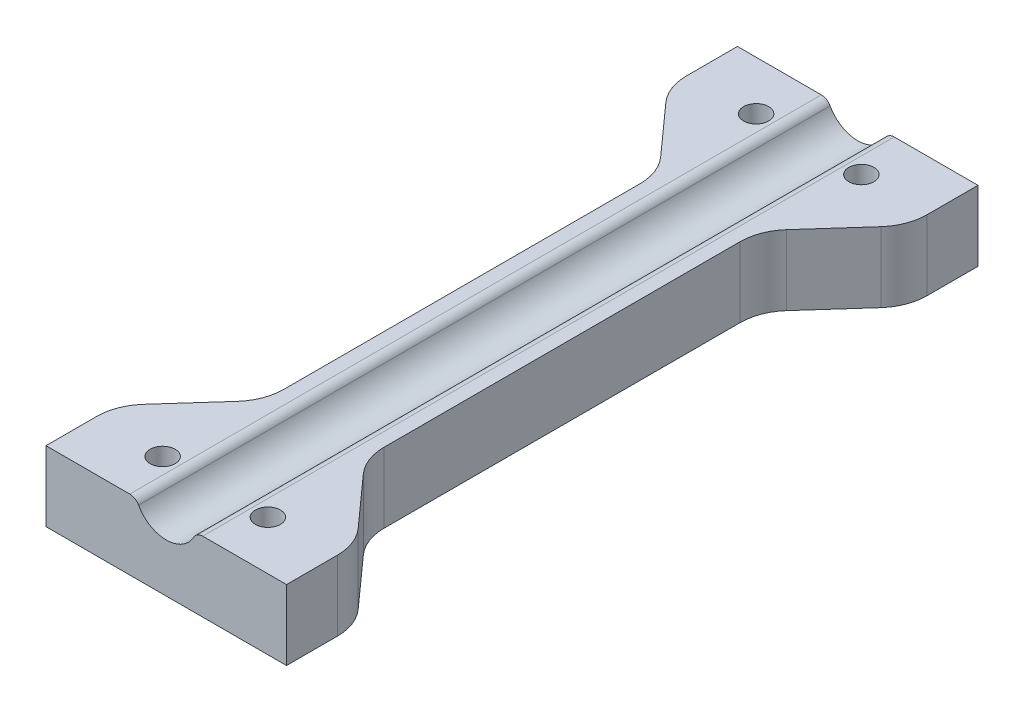
ISO-10303-21;
HEADER;
FILE_DESCRIPTION(('STEP AP214'),'2;1');
FILE_NAME('part.step','',(''),(''),'','','');
FILE_SCHEMA(('AUTOMOTIVE_DESIGN { 1 0 10303 214 1 1 1 1 }'));
ENDSEC;
DATA;
#1=APPLICATION_CONTEXT('core data for automotive mechanical design processes');
#2=APPLICATION_PROTOCOL_DEFINITION('international standard','automotive_design',2000,#1);
#3=PRODUCT_CONTEXT('',#1,'mechanical');
#4=PRODUCT('Part','Part','',(#3));
#5=PRODUCT_RELATED_PRODUCT_CATEGORY('part','',(#4));
#6=PRODUCT_DEFINITION_FORMATION('','',#4);
#7=PRODUCT_DEFINITION_CONTEXT('part definition',#1,'design');
#8=PRODUCT_DEFINITION('design','',#6,#7);
#9=PRODUCT_DEFINITION_SHAPE('','',#8);
#10=(LENGTH_UNIT() NAMED_UNIT(*) SI_UNIT(.MILLI.,.METRE.));
#11=(NAMED_UNIT(*) PLANE_ANGLE_UNIT() SI_UNIT($,.RADIAN.));
#12=(NAMED_UNIT(*) SI_UNIT($,.STERADIAN.) SOLID_ANGLE_UNIT());
#13=UNCERTAINTY_MEASURE_WITH_UNIT(LENGTH_MEASURE(1.E-05),#10,'distance_accuracy_value','');
#14=(GEOMETRIC_REPRESENTATION_CONTEXT(3) GLOBAL_UNCERTAINTY_ASSIGNED_CONTEXT((#13)) GLOBAL_UNIT_ASSIGNED_CONTEXT((#10,
#11,#12)) REPRESENTATION_CONTEXT('',''));
#15=CARTESIAN_POINT('',(0.,0.,0.));
#16=DIRECTION('',(0.,0.,1.));
#17=DIRECTION('',(1.,0.,0.));
#18=AXIS2_PLACEMENT_3D('',#15,#16,#17);
#19=CARTESIAN_POINT('',(12.,-0.999999999999997,34.5));
#20=DIRECTION('',(-1.,0.,0.));
#21=DIRECTION('',(0.,-1.,0.));
#22=AXIS2_PLACEMENT_3D('',#19,#20,#21);
#23=PLANE('',#22);
#24=DIRECTION('',(0.,0.,-1.));
#25=VECTOR('',#24,1.);
#26=CARTESIAN_POINT('',(12.,-8.,34.5));
#27=LINE('',#26,#25);
#28=CARTESIAN_POINT('',(12.,-8.,34.5));
#29=VERTEX_POINT('',#28);
#30=CARTESIAN_POINT('',(12.,-8.,29.4121761673145));
#31=VERTEX_POINT('',#30);
#32=EDGE_CURVE('E451',#29,#31,#27,.T.);
#33=ORIENTED_EDGE('',*,*,#32,.T.);
#34=DIRECTION('',(0.,1.,0.));
#35=VECTOR('',#34,1.);
#36=CARTESIAN_POINT('',(12.,-0.999999999999994,29.4121761673145));
#37=LINE('',#36,#35);
#38=CARTESIAN_POINT('',(12.,-0.999999999999997,29.4121761673145));
#39=VERTEX_POINT('',#38);
#40=EDGE_CURVE('E222',#31,#39,#37,.T.);
#41=ORIENTED_EDGE('',*,*,#40,.T.);
#42=DIRECTION('',(0.,0.,-1.));
#43=VECTOR('',#42,1.);
#44=CARTESIAN_POINT('',(12.,-0.999999999999997,34.5));
#45=LINE('',#44,#43);
#46=CARTESIAN_POINT('',(12.,-0.999999999999997,34.5));
#47=VERTEX_POINT('',#46);
#48=EDGE_CURVE('E200',#47,#39,#45,.T.);
#49=ORIENTED_EDGE('',*,*,#48,.F.);
#50=DIRECTION('',(0.,1.,0.));
#51=VECTOR('',#50,1.);
#52=CARTESIAN_POINT('',(12.,-0.999999999999997,34.5));
#53=LINE('',#52,#51);
#54=EDGE_CURVE('E208',#29,#47,#53,.T.);
#55=ORIENTED_EDGE('',*,*,#54,.F.);
#56=EDGE_LOOP('',(#33,#41,#49,#55));
#57=FACE_BOUND('',#56,.T.);
#58=ADVANCED_FACE('F38',(#57),#23,.F.);
#59=CARTESIAN_POINT('',(-12.,-1.,34.5));
#60=DIRECTION('',(1.,0.,0.));
#61=DIRECTION('',(0.,1.,0.));
#62=AXIS2_PLACEMENT_3D('',#59,#60,#61);
#63=PLANE('',#62);
#64=DIRECTION('',(0.,0.,-1.));
#65=VECTOR('',#64,1.);
#66=CARTESIAN_POINT('',(-12.,-8.,34.5));
#67=LINE('',#66,#65);
#68=CARTESIAN_POINT('',(-12.,-8.,-29.4121761673145));
#69=VERTEX_POINT('',#68);
#70=CARTESIAN_POINT('',(-12.,-8.,-34.5));
#71=VERTEX_POINT('',#70);
#72=EDGE_CURVE('E453',#69,#71,#67,.T.);
#73=ORIENTED_EDGE('',*,*,#72,.F.);
#74=DIRECTION('',(0.,1.,0.));
#75=VECTOR('',#74,1.);
#76=CARTESIAN_POINT('',(-12.,-0.999999999999946,-29.4121761673145));
#77=LINE('',#76,#75);
#78=CARTESIAN_POINT('',(-12.,-1.,-29.4121761673145));
#79=VERTEX_POINT('',#78);
#80=EDGE_CURVE('E312',#69,#79,#77,.T.);
#81=ORIENTED_EDGE('',*,*,#80,.T.);
#82=DIRECTION('',(0.,0.,-1.));
#83=VECTOR('',#82,1.);
#84=CARTESIAN_POINT('',(-12.,-1.,34.5));
#85=LINE('',#84,#83);
#86=CARTESIAN_POINT('',(-12.,-1.,-34.5));
#87=VERTEX_POINT('',#86);
#88=EDGE_CURVE('E456',#79,#87,#85,.T.);
#89=ORIENTED_EDGE('',*,*,#88,.T.);
#90=DIRECTION('',(0.,-1.,0.));
#91=VECTOR('',#90,1.);
#92=CARTESIAN_POINT('',(-12.,-1.,-34.5));
#93=LINE('',#92,#91);
#94=EDGE_CURVE('E444',#87,#71,#93,.T.);
#95=ORIENTED_EDGE('',*,*,#94,.T.);
#96=EDGE_LOOP('',(#73,#81,#89,#95));
#97=FACE_BOUND('',#96,.T.);
#98=ADVANCED_FACE('F468',(#97),#63,.F.);
#99=CARTESIAN_POINT('',(12.,-0.999999999999997,-29.4121761673145));
#100=VERTEX_POINT('',#99);
#101=CARTESIAN_POINT('',(12.,-0.999999999999997,-34.5));
#102=VERTEX_POINT('',#101);
#103=EDGE_CURVE('E225',#100,#102,#45,.T.);
#104=ORIENTED_EDGE('',*,*,#103,.F.);
#105=DIRECTION('',(0.,1.,0.));
#106=VECTOR('',#105,1.);
#107=CARTESIAN_POINT('',(12.,-1.00000000000003,-29.4121761673145));
#108=LINE('',#107,#106);
#109=CARTESIAN_POINT('',(12.,-8.,-29.4121761673145));
#110=VERTEX_POINT('',#109);
#111=EDGE_CURVE('E330',#100,#110,#108,.F.);
#112=ORIENTED_EDGE('',*,*,#111,.T.);
#113=CARTESIAN_POINT('',(12.,-8.,-34.5));
#114=VERTEX_POINT('',#113);
#115=EDGE_CURVE('E429',#110,#114,#27,.T.);
#116=ORIENTED_EDGE('',*,*,#115,.T.);
#117=DIRECTION('',(0.,1.,0.));
#118=VECTOR('',#117,1.);
#119=CARTESIAN_POINT('',(12.,-0.999999999999997,-34.5));
#120=LINE('',#119,#118);
#121=EDGE_CURVE('E371',#114,#102,#120,.T.);
#122=ORIENTED_EDGE('',*,*,#121,.T.);
#123=EDGE_LOOP('',(#104,#112,#116,#122));
#124=FACE_BOUND('',#123,.T.);
#125=ADVANCED_FACE('F476',(#124),#23,.F.);
#126=CARTESIAN_POINT('',(12.,-0.999999999999997,34.5));
#127=DIRECTION('',(0.,-1.,0.));
#128=DIRECTION('',(1.,0.,0.));
#129=AXIS2_PLACEMENT_3D('',#126,#127,#128);
#130=PLANE('',#129);
#131=CARTESIAN_POINT('',(5.25,-0.999999999999999,29.6101918186068));
#132=DIRECTION('',(0.,1.,0.));
#133=DIRECTION('',(1.,0.,0.));
#134=AXIS2_PLACEMENT_3D('',#131,#132,#133);
#135=CIRCLE('',#134,1.25);
#136=CARTESIAN_POINT('',(6.5,-0.999999999999999,29.6101918186068));
#137=VERTEX_POINT('',#136);
#138=EDGE_CURVE('E496',#137,#137,#135,.T.);
#139=ORIENTED_EDGE('',*,*,#138,.F.);
#140=EDGE_LOOP('',(#139));
#141=FACE_BOUND('',#140,.T.);
#142=CARTESIAN_POINT('',(5.25,-0.999999999999999,-29.6101918186068));
#143=DIRECTION('',(0.,1.,0.));
#144=DIRECTION('',(-1.,0.,0.));
#145=AXIS2_PLACEMENT_3D('',#142,#143,#144);
#146=CIRCLE('',#145,1.25);
#147=CARTESIAN_POINT('',(4.,-0.999999999999999,-29.6101918186068));
#148=VERTEX_POINT('',#147);
#149=EDGE_CURVE('E488',#148,#148,#146,.T.);
#150=ORIENTED_EDGE('',*,*,#149,.F.);
#151=EDGE_LOOP('',(#150));
#152=FACE_BOUND('',#151,.T.);
#153=ORIENTED_EDGE('',*,*,#48,.T.);
#154=CARTESIAN_POINT('',(7.,-0.999999999999998,29.4121761673145));
#155=DIRECTION('',(0.,-1.,0.));
#156=DIRECTION('',(1.,0.,0.));
#157=AXIS2_PLACEMENT_3D('',#154,#155,#156);
#158=CIRCLE('',#157,5.);
#159=CARTESIAN_POINT('',(10.7240492744831,-0.999999999999997,26.0757923462858));
#160=VERTEX_POINT('',#159);
#161=EDGE_CURVE('E309',#39,#160,#158,.F.);
#162=ORIENTED_EDGE('',*,*,#161,.T.);
#163=DIRECTION('',(0.667276764205734,0.,0.74480985489662));
#164=VECTOR('',#163,1.);
#165=CARTESIAN_POINT('',(12.,-0.999999999999997,27.5));
#166=LINE('',#165,#164);
#167=CARTESIAN_POINT('',(6.2759507255169,-0.999999999999999,21.1108545385609));
#168=VERTEX_POINT('',#167);
#169=EDGE_CURVE('E400',#168,#160,#166,.T.);
#170=ORIENTED_EDGE('',*,*,#169,.F.);
#171=CARTESIAN_POINT('',(10.,-0.999999999999998,17.7744707175322));
#172=DIRECTION('',(0.,-1.,0.));
#173=DIRECTION('',(1.,0.,0.));
#174=AXIS2_PLACEMENT_3D('',#171,#172,#173);
#175=CIRCLE('',#174,5.);
#176=CARTESIAN_POINT('',(5.,-0.999999999999999,17.7744707175322));
#177=VERTEX_POINT('',#176);
#178=EDGE_CURVE('E339',#168,#177,#175,.T.);
#179=ORIENTED_EDGE('',*,*,#178,.T.);
#180=DIRECTION('',(0.,0.,1.));
#181=VECTOR('',#180,1.);
#182=CARTESIAN_POINT('',(5.,-0.999999999999999,-19.6866468848466));
#183=LINE('',#182,#181);
#184=CARTESIAN_POINT('',(5.,-0.999999999999999,-17.7744707175322));
#185=VERTEX_POINT('',#184);
#186=EDGE_CURVE('E410',#185,#177,#183,.T.);
#187=ORIENTED_EDGE('',*,*,#186,.F.);
#188=CARTESIAN_POINT('',(10.,-0.999999999999998,-17.7744707175322));
#189=DIRECTION('',(0.,-1.,0.));
#190=DIRECTION('',(1.,0.,0.));
#191=AXIS2_PLACEMENT_3D('',#188,#189,#190);
#192=CIRCLE('',#191,5.);
#193=CARTESIAN_POINT('',(6.27595072551689,-0.999999999999999,-21.1108545385609));
#194=VERTEX_POINT('',#193);
#195=EDGE_CURVE('E47',#185,#194,#192,.T.);
#196=ORIENTED_EDGE('',*,*,#195,.T.);
#197=DIRECTION('',(-0.667276764205734,0.,0.74480985489662));
#198=VECTOR('',#197,1.);
#199=CARTESIAN_POINT('',(12.,-0.999999999999997,-27.5));
#200=LINE('',#199,#198);
#201=CARTESIAN_POINT('',(10.7240492744831,-0.999999999999997,-26.0757923462858));
#202=VERTEX_POINT('',#201);
#203=EDGE_CURVE('E407',#202,#194,#200,.T.);
#204=ORIENTED_EDGE('',*,*,#203,.F.);
#205=CARTESIAN_POINT('',(7.,-0.999999999999999,-29.4121761673145));
#206=DIRECTION('',(0.,-1.,0.));
#207=DIRECTION('',(1.,0.,0.));
#208=AXIS2_PLACEMENT_3D('',#205,#206,#207);
#209=CIRCLE('',#208,5.);
#210=EDGE_CURVE('E54',#202,#100,#209,.F.);
#211=ORIENTED_EDGE('',*,*,#210,.T.);
#212=ORIENTED_EDGE('',*,*,#103,.T.);
#213=DIRECTION('',(-1.,0.,0.));
#214=VECTOR('',#213,1.);
#215=CARTESIAN_POINT('',(12.,-0.999999999999997,-34.5));
#216=LINE('',#215,#214);
#217=CARTESIAN_POINT('',(3.63627556711534,-0.999999999999999,-34.5));
#218=VERTEX_POINT('',#217);
#219=EDGE_CURVE('E433',#102,#218,#216,.T.);
#220=ORIENTED_EDGE('',*,*,#219,.T.);
#221=DIRECTION('',(0.,0.,-1.));
#222=VECTOR('',#221,1.);
#223=CARTESIAN_POINT('',(3.63627556711534,-0.999999999999999,34.5));
#224=LINE('',#223,#222);
#225=CARTESIAN_POINT('',(3.63627556711534,-0.999999999999999,34.5));
#226=VERTEX_POINT('',#225);
#227=EDGE_CURVE('E203',#218,#226,#224,.F.);
#228=ORIENTED_EDGE('',*,*,#227,.T.);
#229=DIRECTION('',(-1.,0.,0.));
#230=VECTOR('',#229,1.);
#231=CARTESIAN_POINT('',(12.,-0.999999999999997,34.5));
#232=LINE('',#231,#230);
#233=EDGE_CURVE('E196',#47,#226,#232,.T.);
#234=ORIENTED_EDGE('',*,*,#233,.F.);
#235=EDGE_LOOP('',(#153,#162,#170,#179,#187,#196,#204,#211,#212,#220,#228,#234));
#236=FACE_BOUND('',#235,.T.);
#237=ADVANCED_FACE('F198',(#141,#152,#236),#130,.F.);
#238=CARTESIAN_POINT('',(0.,0.,34.5));
#239=DIRECTION('',(0.,0.,-1.));
#240=DIRECTION('',(-1.,0.,0.));
#241=AXIS2_PLACEMENT_3D('',#238,#239,#240);
#242=CYLINDRICAL_SURFACE('',#241,3.15);
#243=CARTESIAN_POINT('',(0.,0.,34.5));
#244=DIRECTION('',(0.,0.,-1.));
#245=DIRECTION('',(1.,0.,0.));
#246=AXIS2_PLACEMENT_3D('',#243,#244,#245);
#247=CIRCLE('',#246,3.15);
#248=CARTESIAN_POINT('',(2.76006458708755,-1.51807228915663,34.5));
#249=VERTEX_POINT('',#248);
#250=CARTESIAN_POINT('',(-2.76006458708755,-1.51807228915663,34.5));
#251=VERTEX_POINT('',#250);
#252=EDGE_CURVE('E207',#249,#251,#247,.T.);
#253=ORIENTED_EDGE('',*,*,#252,.F.);
#254=DIRECTION('',(0.,0.,-1.));
#255=VECTOR('',#254,1.);
#256=CARTESIAN_POINT('',(2.76006458708755,-1.51807228915663,34.5));
#257=LINE('',#256,#255);
#258=CARTESIAN_POINT('',(2.76006458708755,-1.51807228915663,-34.5));
#259=VERTEX_POINT('',#258);
#260=EDGE_CURVE('E229',#249,#259,#257,.T.);
#261=ORIENTED_EDGE('',*,*,#260,.T.);
#262=CARTESIAN_POINT('',(0.,0.,-34.5));
#263=DIRECTION('',(0.,0.,-1.));
#264=DIRECTION('',(1.,0.,0.));
#265=AXIS2_PLACEMENT_3D('',#262,#263,#264);
#266=CIRCLE('',#265,3.15);
#267=CARTESIAN_POINT('',(-2.76006458708755,-1.51807228915663,-34.5));
#268=VERTEX_POINT('',#267);
#269=EDGE_CURVE('E436',#259,#268,#266,.T.);
#270=ORIENTED_EDGE('',*,*,#269,.T.);
#271=DIRECTION('',(0.,0.,-1.));
#272=VECTOR('',#271,1.);
#273=CARTESIAN_POINT('',(-2.76006458708755,-1.51807228915663,34.5));
#274=LINE('',#273,#272);
#275=EDGE_CURVE('E224',#268,#251,#274,.F.);
#276=ORIENTED_EDGE('',*,*,#275,.T.);
#277=EDGE_LOOP('',(#253,#261,#270,#276));
#278=FACE_BOUND('',#277,.T.);
#279=ADVANCED_FACE('F532',(#278),#242,.F.);
#280=CARTESIAN_POINT('',(-12.,-1.,34.5));
#281=DIRECTION('',(0.,-1.,0.));
#282=DIRECTION('',(0.,0.,-1.));
#283=AXIS2_PLACEMENT_3D('',#280,#281,#282);
#284=PLANE('',#283);
#285=CARTESIAN_POINT('',(-5.25,-1.,29.6101918186068));
#286=DIRECTION('',(0.,1.,0.));
#287=DIRECTION('',(1.,0.,0.));
#288=AXIS2_PLACEMENT_3D('',#285,#286,#287);
#289=CIRCLE('',#288,1.25);
#290=CARTESIAN_POINT('',(-4.,-1.,29.6101918186068));
#291=VERTEX_POINT('',#290);
#292=EDGE_CURVE('E504',#291,#291,#289,.T.);
#293=ORIENTED_EDGE('',*,*,#292,.F.);
#294=EDGE_LOOP('',(#293));
#295=FACE_BOUND('',#294,.T.);
#296=CARTESIAN_POINT('',(-5.25,-1.,-29.6101918186068));
#297=DIRECTION('',(0.,1.,0.));
#298=DIRECTION('',(-1.,0.,0.));
#299=AXIS2_PLACEMENT_3D('',#296,#297,#298);
#300=CIRCLE('',#299,1.25);
#301=CARTESIAN_POINT('',(-6.5,-1.,-29.6101918186068));
#302=VERTEX_POINT('',#301);
#303=EDGE_CURVE('E512',#302,#302,#300,.T.);
#304=ORIENTED_EDGE('',*,*,#303,.F.);
#305=EDGE_LOOP('',(#304));
#306=FACE_BOUND('',#305,.T.);
#307=DIRECTION('',(0.667276764205734,0.,-0.74480985489662));
#308=VECTOR('',#307,1.);
#309=CARTESIAN_POINT('',(-12.,-1.,27.5));
#310=LINE('',#309,#308);
#311=CARTESIAN_POINT('',(-10.7240492744831,-1.,26.0757923462858));
#312=VERTEX_POINT('',#311);
#313=CARTESIAN_POINT('',(-6.2759507255169,-1.,21.1108545385609));
#314=VERTEX_POINT('',#313);
#315=EDGE_CURVE('E385',#312,#314,#310,.T.);
#316=ORIENTED_EDGE('',*,*,#315,.F.);
#317=CARTESIAN_POINT('',(-7.,-1.,29.4121761673145));
#318=DIRECTION('',(0.,-1.,0.));
#319=DIRECTION('',(0.,0.,-1.));
#320=AXIS2_PLACEMENT_3D('',#317,#318,#319);
#321=CIRCLE('',#320,5.);
#322=CARTESIAN_POINT('',(-12.,-1.,29.4121761673145));
#323=VERTEX_POINT('',#322);
#324=EDGE_CURVE('E266',#312,#323,#321,.F.);
#325=ORIENTED_EDGE('',*,*,#324,.T.);
#326=CARTESIAN_POINT('',(-12.,-1.,34.5));
#327=VERTEX_POINT('',#326);
#328=EDGE_CURVE('E231',#327,#323,#85,.T.);
#329=ORIENTED_EDGE('',*,*,#328,.F.);
#330=DIRECTION('',(-1.,0.,0.));
#331=VECTOR('',#330,1.);
#332=CARTESIAN_POINT('',(-12.,-1.,34.5));
#333=LINE('',#332,#331);
#334=CARTESIAN_POINT('',(-3.63627556711534,-1.,34.5));
#335=VERTEX_POINT('',#334);
#336=EDGE_CURVE('E421',#335,#327,#333,.T.);
#337=ORIENTED_EDGE('',*,*,#336,.F.);
#338=DIRECTION('',(0.,0.,-1.));
#339=VECTOR('',#338,1.);
#340=CARTESIAN_POINT('',(-3.63627556711534,-1.,34.5));
#341=LINE('',#340,#339);
#342=CARTESIAN_POINT('',(-3.63627556711534,-1.,-34.5));
#343=VERTEX_POINT('',#342);
#344=EDGE_CURVE('E252',#335,#343,#341,.T.);
#345=ORIENTED_EDGE('',*,*,#344,.T.);
#346=DIRECTION('',(-1.,0.,0.));
#347=VECTOR('',#346,1.);
#348=CARTESIAN_POINT('',(-12.,-1.,-34.5));
#349=LINE('',#348,#347);
#350=EDGE_CURVE('E440',#343,#87,#349,.T.);
#351=ORIENTED_EDGE('',*,*,#350,.T.);
#352=ORIENTED_EDGE('',*,*,#88,.F.);
#353=CARTESIAN_POINT('',(-7.,-1.,-29.4121761673145));
#354=DIRECTION('',(0.,-1.,0.));
#355=DIRECTION('',(0.,0.,-1.));
#356=AXIS2_PLACEMENT_3D('',#353,#354,#355);
#357=CIRCLE('',#356,5.);
#358=CARTESIAN_POINT('',(-10.7240492744831,-1.,-26.0757923462858));
#359=VERTEX_POINT('',#358);
#360=EDGE_CURVE('E263',#79,#359,#357,.F.);
#361=ORIENTED_EDGE('',*,*,#360,.T.);
#362=DIRECTION('',(-0.667276764205734,0.,-0.74480985489662));
#363=VECTOR('',#362,1.);
#364=CARTESIAN_POINT('',(-12.,-1.,-27.5));
#365=LINE('',#364,#363);
#366=CARTESIAN_POINT('',(-6.2759507255169,-1.,-21.1108545385609));
#367=VERTEX_POINT('',#366);
#368=EDGE_CURVE('E380',#367,#359,#365,.T.);
#369=ORIENTED_EDGE('',*,*,#368,.F.);
#370=CARTESIAN_POINT('',(-10.,-1.,-17.7744707175322));
#371=DIRECTION('',(0.,-1.,0.));
#372=DIRECTION('',(0.,0.,-1.));
#373=AXIS2_PLACEMENT_3D('',#370,#371,#372);
#374=CIRCLE('',#373,5.);
#375=CARTESIAN_POINT('',(-5.,-1.,-17.7744707175322));
#376=VERTEX_POINT('',#375);
#377=EDGE_CURVE('E345',#367,#376,#374,.T.);
#378=ORIENTED_EDGE('',*,*,#377,.T.);
#379=DIRECTION('',(0.,0.,-1.));
#380=VECTOR('',#379,1.);
#381=CARTESIAN_POINT('',(-5.,-1.,-19.6866468848466));
#382=LINE('',#381,#380);
#383=CARTESIAN_POINT('',(-5.,-1.,17.7744707175322));
#384=VERTEX_POINT('',#383);
#385=EDGE_CURVE('E379',#384,#376,#382,.T.);
#386=ORIENTED_EDGE('',*,*,#385,.F.);
#387=CARTESIAN_POINT('',(-10.,-1.,17.7744707175322));
#388=DIRECTION('',(0.,-1.,0.));
#389=DIRECTION('',(0.,0.,-1.));
#390=AXIS2_PLACEMENT_3D('',#387,#388,#389);
#391=CIRCLE('',#390,5.);
#392=EDGE_CURVE('E333',#384,#314,#391,.T.);
#393=ORIENTED_EDGE('',*,*,#392,.T.);
#394=EDGE_LOOP('',(#316,#325,#329,#337,#345,#351,#352,#361,#369,#378,#386,#393));
#395=FACE_BOUND('',#394,.T.);
#396=ADVANCED_FACE('F378',(#295,#306,#395),#284,.F.);
#397=ORIENTED_EDGE('',*,*,#328,.T.);
#398=DIRECTION('',(0.,1.,0.));
#399=VECTOR('',#398,1.);
#400=CARTESIAN_POINT('',(-12.,-1.,29.4121761673145));
#401=LINE('',#400,#399);
#402=CARTESIAN_POINT('',(-12.,-8.,29.4121761673145));
#403=VERTEX_POINT('',#402);
#404=EDGE_CURVE('E269',#323,#403,#401,.F.);
#405=ORIENTED_EDGE('',*,*,#404,.T.);
#406=CARTESIAN_POINT('',(-12.,-8.,34.5));
#407=VERTEX_POINT('',#406);
#408=EDGE_CURVE('E454',#407,#403,#67,.T.);
#409=ORIENTED_EDGE('',*,*,#408,.F.);
#410=DIRECTION('',(0.,-1.,0.));
#411=VECTOR('',#410,1.);
#412=CARTESIAN_POINT('',(-12.,-1.,34.5));
#413=LINE('',#412,#411);
#414=EDGE_CURVE('E424',#327,#407,#413,.T.);
#415=ORIENTED_EDGE('',*,*,#414,.F.);
#416=EDGE_LOOP('',(#397,#405,#409,#415));
#417=FACE_BOUND('',#416,.T.);
#418=ADVANCED_FACE('F531',(#417),#63,.F.);
#419=CARTESIAN_POINT('',(-12.,-8.,34.5));
#420=DIRECTION('',(0.,1.,0.));
#421=DIRECTION('',(-1.,0.,0.));
#422=AXIS2_PLACEMENT_3D('',#419,#420,#421);
#423=PLANE('',#422);
#424=CARTESIAN_POINT('',(5.25,-8.00000000000001,29.6101918186068));
#425=DIRECTION('',(0.,1.,0.));
#426=DIRECTION('',(1.,0.,0.));
#427=AXIS2_PLACEMENT_3D('',#424,#425,#426);
#428=CIRCLE('',#427,1.25);
#429=CARTESIAN_POINT('',(6.5,-8.00000000000001,29.6101918186068));
#430=VERTEX_POINT('',#429);
#431=EDGE_CURVE('E500',#430,#430,#428,.T.);
#432=ORIENTED_EDGE('',*,*,#431,.T.);
#433=EDGE_LOOP('',(#432));
#434=FACE_BOUND('',#433,.T.);
#435=CARTESIAN_POINT('',(-5.25,-8.00000000000001,29.6101918186068));
#436=DIRECTION('',(0.,1.,0.));
#437=DIRECTION('',(1.,0.,0.));
#438=AXIS2_PLACEMENT_3D('',#435,#436,#437);
#439=CIRCLE('',#438,1.25);
#440=CARTESIAN_POINT('',(-4.,-8.00000000000001,29.6101918186068));
#441=VERTEX_POINT('',#440);
#442=EDGE_CURVE('E508',#441,#441,#439,.T.);
#443=ORIENTED_EDGE('',*,*,#442,.T.);
#444=EDGE_LOOP('',(#443));
#445=FACE_BOUND('',#444,.T.);
#446=CARTESIAN_POINT('',(-5.25,-8.00000000000001,-29.6101918186068));
#447=DIRECTION('',(0.,1.,0.));
#448=DIRECTION('',(-1.,0.,0.));
#449=AXIS2_PLACEMENT_3D('',#446,#447,#448);
#450=CIRCLE('',#449,1.25);
#451=CARTESIAN_POINT('',(-6.5,-8.00000000000001,-29.6101918186068));
#452=VERTEX_POINT('',#451);
#453=EDGE_CURVE('E492',#452,#452,#450,.T.);
#454=ORIENTED_EDGE('',*,*,#453,.T.);
#455=EDGE_LOOP('',(#454));
#456=FACE_BOUND('',#455,.T.);
#457=CARTESIAN_POINT('',(5.25,-8.00000000000001,-29.6101918186068));
#458=DIRECTION('',(0.,1.,0.));
#459=DIRECTION('',(-1.,0.,0.));
#460=AXIS2_PLACEMENT_3D('',#457,#458,#459);
#461=CIRCLE('',#460,1.25);
#462=CARTESIAN_POINT('',(4.,-8.00000000000001,-29.6101918186068));
#463=VERTEX_POINT('',#462);
#464=EDGE_CURVE('E411',#463,#463,#461,.T.);
#465=ORIENTED_EDGE('',*,*,#464,.T.);
#466=EDGE_LOOP('',(#465));
#467=FACE_BOUND('',#466,.T.);
#468=ORIENTED_EDGE('',*,*,#408,.T.);
#469=CARTESIAN_POINT('',(-7.,-8.,29.4121761673145));
#470=DIRECTION('',(0.,1.,0.));
#471=DIRECTION('',(-1.,0.,0.));
#472=AXIS2_PLACEMENT_3D('',#469,#470,#471);
#473=CIRCLE('',#472,5.);
#474=CARTESIAN_POINT('',(-10.7240492744831,-8.00000000000001,26.0757923462858));
#475=VERTEX_POINT('',#474);
#476=EDGE_CURVE('E281',#403,#475,#473,.F.);
#477=ORIENTED_EDGE('',*,*,#476,.T.);
#478=DIRECTION('',(0.667276764205734,0.,-0.74480985489662));
#479=VECTOR('',#478,1.);
#480=CARTESIAN_POINT('',(-12.,-8.00000000000001,27.5));
#481=LINE('',#480,#479);
#482=CARTESIAN_POINT('',(-6.27595072551689,-8.00000000000001,21.1108545385609));
#483=VERTEX_POINT('',#482);
#484=EDGE_CURVE('E389',#475,#483,#481,.T.);
#485=ORIENTED_EDGE('',*,*,#484,.T.);
#486=CARTESIAN_POINT('',(-9.99999999999999,-8.,17.7744707175322));
#487=DIRECTION('',(0.,1.,0.));
#488=DIRECTION('',(-1.,0.,0.));
#489=AXIS2_PLACEMENT_3D('',#486,#487,#488);
#490=CIRCLE('',#489,5.);
#491=CARTESIAN_POINT('',(-5.,-8.,17.7744707175322));
#492=VERTEX_POINT('',#491);
#493=EDGE_CURVE('E336',#483,#492,#490,.T.);
#494=ORIENTED_EDGE('',*,*,#493,.T.);
#495=DIRECTION('',(0.,0.,-1.));
#496=VECTOR('',#495,1.);
#497=CARTESIAN_POINT('',(-5.,-8.,-19.6866468848466));
#498=LINE('',#497,#496);
#499=CARTESIAN_POINT('',(-5.,-8.,-17.7744707175322));
#500=VERTEX_POINT('',#499);
#501=EDGE_CURVE('E361',#492,#500,#498,.T.);
#502=ORIENTED_EDGE('',*,*,#501,.T.);
#503=CARTESIAN_POINT('',(-9.99999999999999,-8.,-17.7744707175322));
#504=DIRECTION('',(0.,1.,0.));
#505=DIRECTION('',(-1.,0.,0.));
#506=AXIS2_PLACEMENT_3D('',#503,#504,#505);
#507=CIRCLE('',#506,5.);
#508=CARTESIAN_POINT('',(-6.27595072551689,-8.00000000000001,-21.1108545385609));
#509=VERTEX_POINT('',#508);
#510=EDGE_CURVE('E348',#500,#509,#507,.T.);
#511=ORIENTED_EDGE('',*,*,#510,.T.);
#512=DIRECTION('',(-0.667276764205734,0.,-0.74480985489662));
#513=VECTOR('',#512,1.);
#514=CARTESIAN_POINT('',(-12.,-8.00000000000001,-27.5));
#515=LINE('',#514,#513);
#516=CARTESIAN_POINT('',(-10.7240492744831,-8.00000000000001,-26.0757923462858));
#517=VERTEX_POINT('',#516);
#518=EDGE_CURVE('E358',#509,#517,#515,.T.);
#519=ORIENTED_EDGE('',*,*,#518,.T.);
#520=CARTESIAN_POINT('',(-7.,-8.,-29.4121761673145));
#521=DIRECTION('',(0.,1.,0.));
#522=DIRECTION('',(-1.,0.,0.));
#523=AXIS2_PLACEMENT_3D('',#520,#521,#522);
#524=CIRCLE('',#523,5.);
#525=EDGE_CURVE('E275',#517,#69,#524,.F.);
#526=ORIENTED_EDGE('',*,*,#525,.T.);
#527=ORIENTED_EDGE('',*,*,#72,.T.);
#528=DIRECTION('',(1.,0.,0.));
#529=VECTOR('',#528,1.);
#530=CARTESIAN_POINT('',(-12.,-8.,-34.5));
#531=LINE('',#530,#529);
#532=EDGE_CURVE('E218',#71,#114,#531,.T.);
#533=ORIENTED_EDGE('',*,*,#532,.T.);
#534=ORIENTED_EDGE('',*,*,#115,.F.);
#535=CARTESIAN_POINT('',(7.,-8.,-29.4121761673145));
#536=DIRECTION('',(0.,1.,0.));
#537=DIRECTION('',(-1.,0.,0.));
#538=AXIS2_PLACEMENT_3D('',#535,#536,#537);
#539=CIRCLE('',#538,5.);
#540=CARTESIAN_POINT('',(10.7240492744831,-8.,-26.0757923462858));
#541=VERTEX_POINT('',#540);
#542=EDGE_CURVE('E272',#110,#541,#539,.F.);
#543=ORIENTED_EDGE('',*,*,#542,.T.);
#544=DIRECTION('',(-0.667276764205734,0.,0.74480985489662));
#545=VECTOR('',#544,1.);
#546=CARTESIAN_POINT('',(12.,-8.,-27.5));
#547=LINE('',#546,#545);
#548=CARTESIAN_POINT('',(6.2759507255169,-8.,-21.1108545385609));
#549=VERTEX_POINT('',#548);
#550=EDGE_CURVE('E395',#541,#549,#547,.T.);
#551=ORIENTED_EDGE('',*,*,#550,.T.);
#552=CARTESIAN_POINT('',(10.,-8.,-17.7744707175322));
#553=DIRECTION('',(0.,1.,0.));
#554=DIRECTION('',(-1.,0.,0.));
#555=AXIS2_PLACEMENT_3D('',#552,#553,#554);
#556=CIRCLE('',#555,5.);
#557=CARTESIAN_POINT('',(5.,-8.,-17.7744707175322));
#558=VERTEX_POINT('',#557);
#559=EDGE_CURVE('E11',#549,#558,#556,.T.);
#560=ORIENTED_EDGE('',*,*,#559,.T.);
#561=DIRECTION('',(0.,0.,1.));
#562=VECTOR('',#561,1.);
#563=CARTESIAN_POINT('',(5.,-8.,-19.6866468848466));
#564=LINE('',#563,#562);
#565=CARTESIAN_POINT('',(5.,-8.,17.7744707175322));
#566=VERTEX_POINT('',#565);
#567=EDGE_CURVE('E399',#558,#566,#564,.T.);
#568=ORIENTED_EDGE('',*,*,#567,.T.);
#569=CARTESIAN_POINT('',(10.,-8.,17.7744707175322));
#570=DIRECTION('',(0.,1.,0.));
#571=DIRECTION('',(-1.,0.,0.));
#572=AXIS2_PLACEMENT_3D('',#569,#570,#571);
#573=CIRCLE('',#572,5.);
#574=CARTESIAN_POINT('',(6.2759507255169,-8.,21.1108545385609));
#575=VERTEX_POINT('',#574);
#576=EDGE_CURVE('E342',#566,#575,#573,.T.);
#577=ORIENTED_EDGE('',*,*,#576,.T.);
#578=DIRECTION('',(0.667276764205734,0.,0.74480985489662));
#579=VECTOR('',#578,1.);
#580=CARTESIAN_POINT('',(12.,-8.,27.5));
#581=LINE('',#580,#579);
#582=CARTESIAN_POINT('',(10.7240492744831,-8.,26.0757923462858));
#583=VERTEX_POINT('',#582);
#584=EDGE_CURVE('E392',#575,#583,#581,.T.);
#585=ORIENTED_EDGE('',*,*,#584,.T.);
#586=CARTESIAN_POINT('',(7.,-8.,29.4121761673145));
#587=DIRECTION('',(0.,1.,0.));
#588=DIRECTION('',(-1.,0.,0.));
#589=AXIS2_PLACEMENT_3D('',#586,#587,#588);
#590=CIRCLE('',#589,5.);
#591=EDGE_CURVE('E278',#583,#31,#590,.F.);
#592=ORIENTED_EDGE('',*,*,#591,.T.);
#593=ORIENTED_EDGE('',*,*,#32,.F.);
#594=DIRECTION('',(1.,0.,0.));
#595=VECTOR('',#594,1.);
#596=CARTESIAN_POINT('',(-12.,-8.,34.5));
#597=LINE('',#596,#595);
#598=EDGE_CURVE('E213',#407,#29,#597,.T.);
#599=ORIENTED_EDGE('',*,*,#598,.F.);
#600=EDGE_LOOP('',(#468,#477,#485,#494,#502,#511,#519,#526,#527,#533,#534,#543,#551,#560,#568,
#577,#585,#592,#593,#599));
#601=FACE_BOUND('',#600,.T.);
#602=ADVANCED_FACE('F357',(#434,#445,#456,#467,#601),#423,.F.);
#603=CARTESIAN_POINT('',(0.,0.,34.5));
#604=DIRECTION('',(0.,0.,1.));
#605=DIRECTION('',(1.,0.,0.));
#606=AXIS2_PLACEMENT_3D('',#603,#604,#605);
#607=PLANE('',#606);
#608=ORIENTED_EDGE('',*,*,#233,.T.);
#609=CARTESIAN_POINT('',(3.63627556711534,-2.,34.5));
#610=DIRECTION('',(0.,0.,1.));
#611=DIRECTION('',(1.,0.,0.));
#612=AXIS2_PLACEMENT_3D('',#609,#610,#611);
#613=CIRCLE('',#612,1.);
#614=EDGE_CURVE('E249',#226,#249,#613,.T.);
#615=ORIENTED_EDGE('',*,*,#614,.T.);
#616=ORIENTED_EDGE('',*,*,#252,.T.);
#617=CARTESIAN_POINT('',(-3.63627556711534,-2.,34.5));
#618=DIRECTION('',(0.,0.,1.));
#619=DIRECTION('',(1.,0.,0.));
#620=AXIS2_PLACEMENT_3D('',#617,#618,#619);
#621=CIRCLE('',#620,1.);
#622=EDGE_CURVE('E246',#251,#335,#621,.T.);
#623=ORIENTED_EDGE('',*,*,#622,.T.);
#624=ORIENTED_EDGE('',*,*,#336,.T.);
#625=ORIENTED_EDGE('',*,*,#414,.T.);
#626=ORIENTED_EDGE('',*,*,#598,.T.);
#627=ORIENTED_EDGE('',*,*,#54,.T.);
#628=EDGE_LOOP('',(#608,#615,#616,#623,#624,#625,#626,#627));
#629=FACE_BOUND('',#628,.T.);
#630=ADVANCED_FACE('F211',(#629),#607,.T.);
#631=CARTESIAN_POINT('',(0.,0.,-34.5));
#632=DIRECTION('',(0.,0.,1.));
#633=DIRECTION('',(1.,0.,0.));
#634=AXIS2_PLACEMENT_3D('',#631,#632,#633);
#635=PLANE('',#634);
#636=ORIENTED_EDGE('',*,*,#269,.F.);
#637=CARTESIAN_POINT('',(3.63627556711534,-2.,-34.5));
#638=DIRECTION('',(0.,0.,1.));
#639=DIRECTION('',(1.,0.,0.));
#640=AXIS2_PLACEMENT_3D('',#637,#638,#639);
#641=CIRCLE('',#640,1.);
#642=EDGE_CURVE('E241',#259,#218,#641,.F.);
#643=ORIENTED_EDGE('',*,*,#642,.T.);
#644=ORIENTED_EDGE('',*,*,#219,.F.);
#645=ORIENTED_EDGE('',*,*,#121,.F.);
#646=ORIENTED_EDGE('',*,*,#532,.F.);
#647=ORIENTED_EDGE('',*,*,#94,.F.);
#648=ORIENTED_EDGE('',*,*,#350,.F.);
#649=CARTESIAN_POINT('',(-3.63627556711534,-2.,-34.5));
#650=DIRECTION('',(0.,0.,1.));
#651=DIRECTION('',(1.,0.,0.));
#652=AXIS2_PLACEMENT_3D('',#649,#650,#651);
#653=CIRCLE('',#652,1.);
#654=EDGE_CURVE('E238',#343,#268,#653,.F.);
#655=ORIENTED_EDGE('',*,*,#654,.T.);
#656=EDGE_LOOP('',(#636,#643,#644,#645,#646,#647,#648,#655));
#657=FACE_BOUND('',#656,.T.);
#658=ADVANCED_FACE('F473',(#657),#635,.F.);
#659=CARTESIAN_POINT('',(3.63627556711534,-2.,34.5));
#660=DIRECTION('',(0.,0.,-1.));
#661=DIRECTION('',(-1.,0.,0.));
#662=AXIS2_PLACEMENT_3D('',#659,#660,#661);
#663=CYLINDRICAL_SURFACE('',#662,1.);
#664=ORIENTED_EDGE('',*,*,#614,.F.);
#665=ORIENTED_EDGE('',*,*,#227,.F.);
#666=ORIENTED_EDGE('',*,*,#642,.F.);
#667=ORIENTED_EDGE('',*,*,#260,.F.);
#668=EDGE_LOOP('',(#664,#665,#666,#667));
#669=FACE_BOUND('',#668,.T.);
#670=ADVANCED_FACE('F601',(#669),#663,.T.);
#671=CARTESIAN_POINT('',(-3.63627556711534,-2.,34.5));
#672=DIRECTION('',(0.,0.,-1.));
#673=DIRECTION('',(-1.,0.,0.));
#674=AXIS2_PLACEMENT_3D('',#671,#672,#673);
#675=CYLINDRICAL_SURFACE('',#674,1.);
#676=ORIENTED_EDGE('',*,*,#622,.F.);
#677=ORIENTED_EDGE('',*,*,#275,.F.);
#678=ORIENTED_EDGE('',*,*,#654,.F.);
#679=ORIENTED_EDGE('',*,*,#344,.F.);
#680=EDGE_LOOP('',(#676,#677,#678,#679));
#681=FACE_BOUND('',#680,.T.);
#682=ADVANCED_FACE('F589',(#681),#675,.T.);
#683=CARTESIAN_POINT('',(12.,-8.,27.5));
#684=DIRECTION('',(-0.74480985489662,0.,0.667276764205734));
#685=DIRECTION('',(0.667276764205734,0.,0.74480985489662));
#686=AXIS2_PLACEMENT_3D('',#683,#684,#685);
#687=PLANE('',#686);
#688=ORIENTED_EDGE('',*,*,#584,.F.);
#689=DIRECTION('',(0.,1.,0.));
#690=VECTOR('',#689,1.);
#691=CARTESIAN_POINT('',(6.27595072551689,-0.999999999999999,21.1108545385609));
#692=LINE('',#691,#690);
#693=EDGE_CURVE('E294',#575,#168,#692,.T.);
#694=ORIENTED_EDGE('',*,*,#693,.T.);
#695=ORIENTED_EDGE('',*,*,#169,.T.);
#696=DIRECTION('',(0.,1.,0.));
#697=VECTOR('',#696,1.);
#698=CARTESIAN_POINT('',(10.7240492744831,-8.,26.0757923462858));
#699=LINE('',#698,#697);
#700=EDGE_CURVE('E291',#160,#583,#699,.F.);
#701=ORIENTED_EDGE('',*,*,#700,.T.);
#702=EDGE_LOOP('',(#688,#694,#695,#701));
#703=FACE_BOUND('',#702,.T.);
#704=ADVANCED_FACE('F585',(#703),#687,.F.);
#705=CARTESIAN_POINT('',(5.,-8.,-19.6866468848466));
#706=DIRECTION('',(-1.,0.,0.));
#707=DIRECTION('',(0.,-1.,0.));
#708=AXIS2_PLACEMENT_3D('',#705,#706,#707);
#709=PLANE('',#708);
#710=ORIENTED_EDGE('',*,*,#186,.T.);
#711=DIRECTION('',(0.,1.,0.));
#712=VECTOR('',#711,1.);
#713=CARTESIAN_POINT('',(5.,-8.,17.7744707175322));
#714=LINE('',#713,#712);
#715=EDGE_CURVE('E302',#177,#566,#714,.F.);
#716=ORIENTED_EDGE('',*,*,#715,.T.);
#717=ORIENTED_EDGE('',*,*,#567,.F.);
#718=DIRECTION('',(0.,1.,0.));
#719=VECTOR('',#718,1.);
#720=CARTESIAN_POINT('',(5.,-0.999999999999999,-17.7744707175322));
#721=LINE('',#720,#719);
#722=EDGE_CURVE('E298',#558,#185,#721,.T.);
#723=ORIENTED_EDGE('',*,*,#722,.T.);
#724=EDGE_LOOP('',(#710,#716,#717,#723));
#725=FACE_BOUND('',#724,.T.);
#726=ADVANCED_FACE('F588',(#725),#709,.F.);
#727=CARTESIAN_POINT('',(12.,-8.,-27.5));
#728=DIRECTION('',(-0.74480985489662,0.,-0.667276764205734));
#729=DIRECTION('',(-0.667276764205734,0.,0.74480985489662));
#730=AXIS2_PLACEMENT_3D('',#727,#728,#729);
#731=PLANE('',#730);
#732=ORIENTED_EDGE('',*,*,#203,.T.);
#733=DIRECTION('',(0.,1.,0.));
#734=VECTOR('',#733,1.);
#735=CARTESIAN_POINT('',(6.27595072551689,-8.,-21.1108545385609));
#736=LINE('',#735,#734);
#737=EDGE_CURVE('E327',#194,#549,#736,.F.);
#738=ORIENTED_EDGE('',*,*,#737,.T.);
#739=ORIENTED_EDGE('',*,*,#550,.F.);
#740=DIRECTION('',(0.,1.,0.));
#741=VECTOR('',#740,1.);
#742=CARTESIAN_POINT('',(10.7240492744831,-8.,-26.0757923462858));
#743=LINE('',#742,#741);
#744=EDGE_CURVE('E323',#541,#202,#743,.T.);
#745=ORIENTED_EDGE('',*,*,#744,.T.);
#746=EDGE_LOOP('',(#732,#738,#739,#745));
#747=FACE_BOUND('',#746,.T.);
#748=ADVANCED_FACE('F577',(#747),#731,.F.);
#749=CARTESIAN_POINT('',(-12.,-8.00000000000001,-27.5));
#750=DIRECTION('',(0.74480985489662,0.,-0.667276764205734));
#751=DIRECTION('',(-0.667276764205734,0.,-0.74480985489662));
#752=AXIS2_PLACEMENT_3D('',#749,#750,#751);
#753=PLANE('',#752);
#754=ORIENTED_EDGE('',*,*,#368,.T.);
#755=DIRECTION('',(0.,1.,0.));
#756=VECTOR('',#755,1.);
#757=CARTESIAN_POINT('',(-10.7240492744831,-8.00000000000001,-26.0757923462858));
#758=LINE('',#757,#756);
#759=EDGE_CURVE('E320',#359,#517,#758,.F.);
#760=ORIENTED_EDGE('',*,*,#759,.T.);
#761=ORIENTED_EDGE('',*,*,#518,.F.);
#762=DIRECTION('',(0.,1.,0.));
#763=VECTOR('',#762,1.);
#764=CARTESIAN_POINT('',(-6.27595072551689,-1.,-21.1108545385609));
#765=LINE('',#764,#763);
#766=EDGE_CURVE('E316',#509,#367,#765,.T.);
#767=ORIENTED_EDGE('',*,*,#766,.T.);
#768=EDGE_LOOP('',(#754,#760,#761,#767));
#769=FACE_BOUND('',#768,.T.);
#770=ADVANCED_FACE('F367',(#769),#753,.F.);
#771=CARTESIAN_POINT('',(-5.,-8.,-19.6866468848466));
#772=DIRECTION('',(1.,0.,0.));
#773=DIRECTION('',(0.,1.,0.));
#774=AXIS2_PLACEMENT_3D('',#771,#772,#773);
#775=PLANE('',#774);
#776=ORIENTED_EDGE('',*,*,#501,.F.);
#777=DIRECTION('',(0.,1.,0.));
#778=VECTOR('',#777,1.);
#779=CARTESIAN_POINT('',(-5.,-1.,17.7744707175322));
#780=LINE('',#779,#778);
#781=EDGE_CURVE('E287',#492,#384,#780,.T.);
#782=ORIENTED_EDGE('',*,*,#781,.T.);
#783=ORIENTED_EDGE('',*,*,#385,.T.);
#784=DIRECTION('',(0.,1.,0.));
#785=VECTOR('',#784,1.);
#786=CARTESIAN_POINT('',(-5.,-8.,-17.7744707175322));
#787=LINE('',#786,#785);
#788=EDGE_CURVE('E284',#376,#500,#787,.F.);
#789=ORIENTED_EDGE('',*,*,#788,.T.);
#790=EDGE_LOOP('',(#776,#782,#783,#789));
#791=FACE_BOUND('',#790,.T.);
#792=ADVANCED_FACE('F382',(#791),#775,.F.);
#793=CARTESIAN_POINT('',(-12.,-8.00000000000001,27.5));
#794=DIRECTION('',(0.74480985489662,0.,0.667276764205734));
#795=DIRECTION('',(0.667276764205734,0.,-0.74480985489662));
#796=AXIS2_PLACEMENT_3D('',#793,#794,#795);
#797=PLANE('',#796);
#798=ORIENTED_EDGE('',*,*,#484,.F.);
#799=DIRECTION('',(0.,1.,0.));
#800=VECTOR('',#799,1.);
#801=CARTESIAN_POINT('',(-10.7240492744831,-8.00000000000001,26.0757923462858));
#802=LINE('',#801,#800);
#803=EDGE_CURVE('E259',#475,#312,#802,.T.);
#804=ORIENTED_EDGE('',*,*,#803,.T.);
#805=ORIENTED_EDGE('',*,*,#315,.T.);
#806=DIRECTION('',(0.,1.,0.));
#807=VECTOR('',#806,1.);
#808=CARTESIAN_POINT('',(-6.27595072551689,-8.,21.1108545385609));
#809=LINE('',#808,#807);
#810=EDGE_CURVE('E256',#314,#483,#809,.F.);
#811=ORIENTED_EDGE('',*,*,#810,.T.);
#812=EDGE_LOOP('',(#798,#804,#805,#811));
#813=FACE_BOUND('',#812,.T.);
#814=ADVANCED_FACE('F580',(#813),#797,.F.);
#815=CARTESIAN_POINT('',(-7.,-8.00000000000001,29.4121761673145));
#816=DIRECTION('',(0.,1.,0.));
#817=DIRECTION('',(0.,0.,1.));
#818=AXIS2_PLACEMENT_3D('',#815,#816,#817);
#819=CYLINDRICAL_SURFACE('',#818,5.);
#820=ORIENTED_EDGE('',*,*,#476,.F.);
#821=ORIENTED_EDGE('',*,*,#404,.F.);
#822=ORIENTED_EDGE('',*,*,#324,.F.);
#823=ORIENTED_EDGE('',*,*,#803,.F.);
#824=EDGE_LOOP('',(#820,#821,#822,#823));
#825=FACE_BOUND('',#824,.T.);
#826=ADVANCED_FACE('F583',(#825),#819,.T.);
#827=CARTESIAN_POINT('',(-9.99999999999999,-8.00000000000001,17.7744707175322));
#828=DIRECTION('',(0.,-1.,0.));
#829=DIRECTION('',(1.,0.,0.));
#830=AXIS2_PLACEMENT_3D('',#827,#828,#829);
#831=CYLINDRICAL_SURFACE('',#830,5.);
#832=ORIENTED_EDGE('',*,*,#493,.F.);
#833=ORIENTED_EDGE('',*,*,#810,.F.);
#834=ORIENTED_EDGE('',*,*,#392,.F.);
#835=ORIENTED_EDGE('',*,*,#781,.F.);
#836=EDGE_LOOP('',(#832,#833,#834,#835));
#837=FACE_BOUND('',#836,.T.);
#838=ADVANCED_FACE('F701',(#837),#831,.F.);
#839=CARTESIAN_POINT('',(10.,-8.,17.7744707175322));
#840=DIRECTION('',(0.,-1.,0.));
#841=DIRECTION('',(1.,0.,0.));
#842=AXIS2_PLACEMENT_3D('',#839,#840,#841);
#843=CYLINDRICAL_SURFACE('',#842,5.);
#844=ORIENTED_EDGE('',*,*,#576,.F.);
#845=ORIENTED_EDGE('',*,*,#715,.F.);
#846=ORIENTED_EDGE('',*,*,#178,.F.);
#847=ORIENTED_EDGE('',*,*,#693,.F.);
#848=EDGE_LOOP('',(#844,#845,#846,#847));
#849=FACE_BOUND('',#848,.T.);
#850=ADVANCED_FACE('F691',(#849),#843,.F.);
#851=CARTESIAN_POINT('',(7.,-0.999999999999993,29.4121761673145));
#852=DIRECTION('',(0.,1.,0.));
#853=DIRECTION('',(0.,0.,1.));
#854=AXIS2_PLACEMENT_3D('',#851,#852,#853);
#855=CYLINDRICAL_SURFACE('',#854,5.);
#856=ORIENTED_EDGE('',*,*,#591,.F.);
#857=ORIENTED_EDGE('',*,*,#700,.F.);
#858=ORIENTED_EDGE('',*,*,#161,.F.);
#859=ORIENTED_EDGE('',*,*,#40,.F.);
#860=EDGE_LOOP('',(#856,#857,#858,#859));
#861=FACE_BOUND('',#860,.T.);
#862=ADVANCED_FACE('F681',(#861),#855,.T.);
#863=CARTESIAN_POINT('',(-7.,-0.999999999999948,-29.4121761673145));
#864=DIRECTION('',(0.,1.,0.));
#865=DIRECTION('',(0.,0.,1.));
#866=AXIS2_PLACEMENT_3D('',#863,#864,#865);
#867=CYLINDRICAL_SURFACE('',#866,5.);
#868=ORIENTED_EDGE('',*,*,#525,.F.);
#869=ORIENTED_EDGE('',*,*,#759,.F.);
#870=ORIENTED_EDGE('',*,*,#360,.F.);
#871=ORIENTED_EDGE('',*,*,#80,.F.);
#872=EDGE_LOOP('',(#868,#869,#870,#871));
#873=FACE_BOUND('',#872,.T.);
#874=ADVANCED_FACE('F672',(#873),#867,.T.);
#875=CARTESIAN_POINT('',(-9.99999999999999,-8.00000000000001,-17.7744707175322));
#876=DIRECTION('',(0.,-1.,0.));
#877=DIRECTION('',(1.,0.,0.));
#878=AXIS2_PLACEMENT_3D('',#875,#876,#877);
#879=CYLINDRICAL_SURFACE('',#878,5.);
#880=ORIENTED_EDGE('',*,*,#510,.F.);
#881=ORIENTED_EDGE('',*,*,#788,.F.);
#882=ORIENTED_EDGE('',*,*,#377,.F.);
#883=ORIENTED_EDGE('',*,*,#766,.F.);
#884=EDGE_LOOP('',(#880,#881,#882,#883));
#885=FACE_BOUND('',#884,.T.);
#886=ADVANCED_FACE('F373',(#885),#879,.F.);
#887=CARTESIAN_POINT('',(10.,-8.,-17.7744707175322));
#888=DIRECTION('',(0.,-1.,0.));
#889=DIRECTION('',(1.,0.,0.));
#890=AXIS2_PLACEMENT_3D('',#887,#888,#889);
#891=CYLINDRICAL_SURFACE('',#890,5.);
#892=ORIENTED_EDGE('',*,*,#559,.F.);
#893=ORIENTED_EDGE('',*,*,#737,.F.);
#894=ORIENTED_EDGE('',*,*,#195,.F.);
#895=ORIENTED_EDGE('',*,*,#722,.F.);
#896=EDGE_LOOP('',(#892,#893,#894,#895));
#897=FACE_BOUND('',#896,.T.);
#898=ADVANCED_FACE('F568',(#897),#891,.F.);
#899=CARTESIAN_POINT('',(7.,-8.,-29.4121761673145));
#900=DIRECTION('',(0.,1.,0.));
#901=DIRECTION('',(0.,0.,1.));
#902=AXIS2_PLACEMENT_3D('',#899,#900,#901);
#903=CYLINDRICAL_SURFACE('',#902,5.);
#904=ORIENTED_EDGE('',*,*,#542,.F.);
#905=ORIENTED_EDGE('',*,*,#111,.F.);
#906=ORIENTED_EDGE('',*,*,#210,.F.);
#907=ORIENTED_EDGE('',*,*,#744,.F.);
#908=EDGE_LOOP('',(#904,#905,#906,#907));
#909=FACE_BOUND('',#908,.T.);
#910=ADVANCED_FACE('F40',(#909),#903,.T.);
#911=CARTESIAN_POINT('',(5.25,-8.00000000000001,-29.6101918186068));
#912=DIRECTION('',(0.,1.,0.));
#913=DIRECTION('',(-1.,0.,0.));
#914=AXIS2_PLACEMENT_3D('',#911,#912,#913);
#915=CYLINDRICAL_SURFACE('',#914,1.25);
#916=ORIENTED_EDGE('',*,*,#464,.F.);
#917=EDGE_LOOP('',(#916));
#918=FACE_BOUND('',#917,.T.);
#919=ORIENTED_EDGE('',*,*,#149,.T.);
#920=EDGE_LOOP('',(#919));
#921=FACE_BOUND('',#920,.T.);
#922=ADVANCED_FACE('F526',(#918,#921),#915,.F.);
#923=CARTESIAN_POINT('',(-5.25,-8.00000000000001,-29.6101918186068));
#924=DIRECTION('',(0.,1.,0.));
#925=DIRECTION('',(-1.,0.,0.));
#926=AXIS2_PLACEMENT_3D('',#923,#924,#925);
#927=CYLINDRICAL_SURFACE('',#926,1.25);
#928=ORIENTED_EDGE('',*,*,#453,.F.);
#929=EDGE_LOOP('',(#928));
#930=FACE_BOUND('',#929,.T.);
#931=ORIENTED_EDGE('',*,*,#303,.T.);
#932=EDGE_LOOP('',(#931));
#933=FACE_BOUND('',#932,.T.);
#934=ADVANCED_FACE('F522',(#930,#933),#927,.F.);
#935=CARTESIAN_POINT('',(-5.25,-8.00000000000001,29.6101918186068));
#936=DIRECTION('',(0.,1.,0.));
#937=DIRECTION('',(-1.,0.,0.));
#938=AXIS2_PLACEMENT_3D('',#935,#936,#937);
#939=CYLINDRICAL_SURFACE('',#938,1.25);
#940=ORIENTED_EDGE('',*,*,#442,.F.);
#941=EDGE_LOOP('',(#940));
#942=FACE_BOUND('',#941,.T.);
#943=ORIENTED_EDGE('',*,*,#292,.T.);
#944=EDGE_LOOP('',(#943));
#945=FACE_BOUND('',#944,.T.);
#946=ADVANCED_FACE('F525',(#942,#945),#939,.F.);
#947=CARTESIAN_POINT('',(5.25,-8.00000000000001,29.6101918186068));
#948=DIRECTION('',(0.,1.,0.));
#949=DIRECTION('',(-1.,0.,0.));
#950=AXIS2_PLACEMENT_3D('',#947,#948,#949);
#951=CYLINDRICAL_SURFACE('',#950,1.25);
#952=ORIENTED_EDGE('',*,*,#431,.F.);
#953=EDGE_LOOP('',(#952));
#954=FACE_BOUND('',#953,.T.);
#955=ORIENTED_EDGE('',*,*,#138,.T.);
#956=EDGE_LOOP('',(#955));
#957=FACE_BOUND('',#956,.T.);
#958=ADVANCED_FACE('F573',(#954,#957),#951,.F.);
#959=CLOSED_SHELL('',(#58,#98,#125,#237,#279,#396,#418,#602,#630,#658,#670,#682,#704,#726,#748,
#770,#792,#814,#826,#838,#850,#862,#874,#886,#898,#910,#922,#934,#946,#958));
#960=MANIFOLD_SOLID_BREP('B2',#959);
#961=ADVANCED_BREP_SHAPE_REPRESENTATION('',(#18,#960),#14);
#962=SHAPE_DEFINITION_REPRESENTATION(#9,#961);
ENDSEC;
END-ISO-10303-21;
